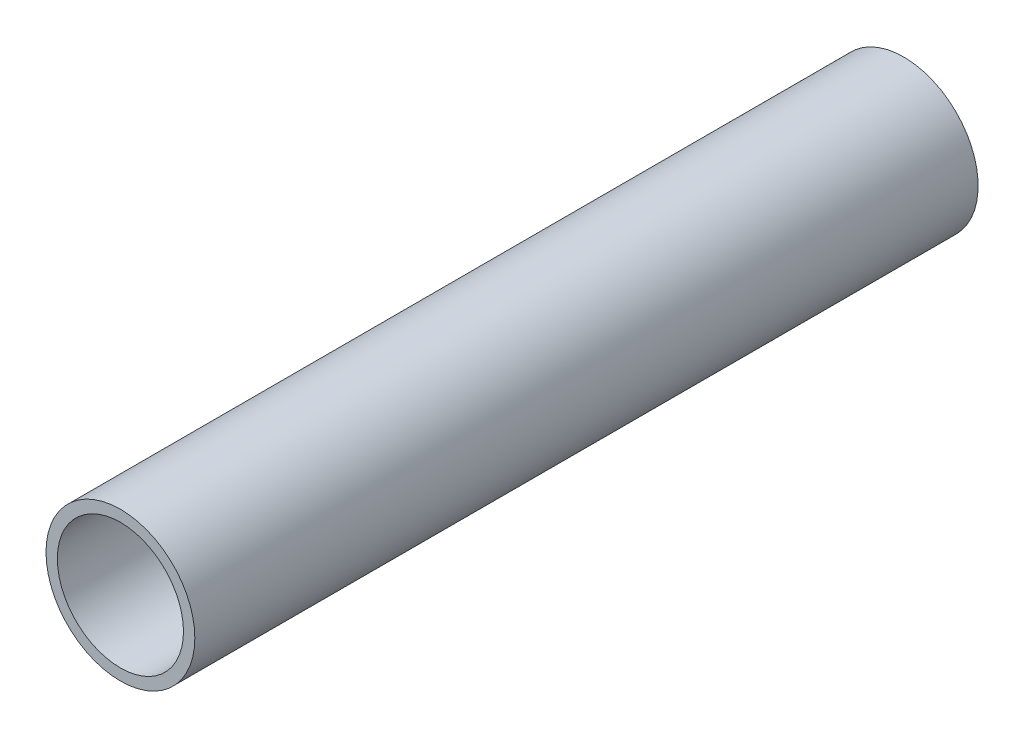
ISO-10303-21;
HEADER;
FILE_DESCRIPTION(('STEP AP214'),'2;1');
FILE_NAME('part.step','',(''),(''),'','','');
FILE_SCHEMA(('AUTOMOTIVE_DESIGN { 1 0 10303 214 1 1 1 1 }'));
ENDSEC;
DATA;
#1=APPLICATION_CONTEXT('core data for automotive mechanical design processes');
#2=APPLICATION_PROTOCOL_DEFINITION('international standard','automotive_design',2000,#1);
#3=PRODUCT_CONTEXT('',#1,'mechanical');
#4=PRODUCT('Part','Part','',(#3));
#5=PRODUCT_RELATED_PRODUCT_CATEGORY('part','',(#4));
#6=PRODUCT_DEFINITION_FORMATION('','',#4);
#7=PRODUCT_DEFINITION_CONTEXT('part definition',#1,'design');
#8=PRODUCT_DEFINITION('design','',#6,#7);
#9=PRODUCT_DEFINITION_SHAPE('','',#8);
#10=(LENGTH_UNIT() NAMED_UNIT(*) SI_UNIT(.MILLI.,.METRE.));
#11=(NAMED_UNIT(*) PLANE_ANGLE_UNIT() SI_UNIT($,.RADIAN.));
#12=(NAMED_UNIT(*) SI_UNIT($,.STERADIAN.) SOLID_ANGLE_UNIT());
#13=UNCERTAINTY_MEASURE_WITH_UNIT(LENGTH_MEASURE(1.E-05),#10,'distance_accuracy_value','');
#14=(GEOMETRIC_REPRESENTATION_CONTEXT(3) GLOBAL_UNCERTAINTY_ASSIGNED_CONTEXT((#13)) GLOBAL_UNIT_ASSIGNED_CONTEXT((#10,
#11,#12)) REPRESENTATION_CONTEXT('',''));
#15=CARTESIAN_POINT('',(0.,0.,0.));
#16=DIRECTION('',(0.,0.,1.));
#17=DIRECTION('',(1.,0.,0.));
#18=AXIS2_PLACEMENT_3D('',#15,#16,#17);
#19=CARTESIAN_POINT('',(0.,0.,762.));
#20=DIRECTION('',(0.,0.,-1.));
#21=DIRECTION('',(-1.,0.,0.));
#22=AXIS2_PLACEMENT_3D('',#19,#20,#21);
#23=CYLINDRICAL_SURFACE('',#22,24.13);
#24=CARTESIAN_POINT('',(0.,0.,-762.));
#25=DIRECTION('',(0.,0.,-1.));
#26=DIRECTION('',(-1.,0.,0.));
#27=AXIS2_PLACEMENT_3D('',#24,#25,#26);
#28=CIRCLE('',#27,24.13);
#29=CARTESIAN_POINT('',(-24.13,0.,-762.));
#30=VERTEX_POINT('',#29);
#31=EDGE_CURVE('E38',#30,#30,#28,.T.);
#32=ORIENTED_EDGE('',*,*,#31,.F.);
#33=EDGE_LOOP('',(#32));
#34=FACE_BOUND('',#33,.T.);
#35=CARTESIAN_POINT('',(0.,0.,-508.));
#36=DIRECTION('',(0.,0.,1.));
#37=DIRECTION('',(1.,0.,0.));
#38=AXIS2_PLACEMENT_3D('',#35,#36,#37);
#39=CIRCLE('',#38,24.13);
#40=CARTESIAN_POINT('',(24.13,0.,-508.));
#41=VERTEX_POINT('',#40);
#42=EDGE_CURVE('E42',#41,#41,#39,.F.);
#43=ORIENTED_EDGE('',*,*,#42,.T.);
#44=EDGE_LOOP('',(#43));
#45=FACE_BOUND('',#44,.T.);
#46=ADVANCED_FACE('F31',(#34,#45),#23,.T.);
#47=CARTESIAN_POINT('',(0.,0.,762.));
#48=DIRECTION('',(0.,0.,-1.));
#49=DIRECTION('',(-1.,0.,0.));
#50=AXIS2_PLACEMENT_3D('',#47,#48,#49);
#51=CYLINDRICAL_SURFACE('',#50,20.447);
#52=CARTESIAN_POINT('',(0.,0.,-762.));
#53=DIRECTION('',(0.,0.,-1.));
#54=DIRECTION('',(-1.,0.,0.));
#55=AXIS2_PLACEMENT_3D('',#52,#53,#54);
#56=CIRCLE('',#55,20.447);
#57=CARTESIAN_POINT('',(-20.447,0.,-762.));
#58=VERTEX_POINT('',#57);
#59=EDGE_CURVE('E10',#58,#58,#56,.T.);
#60=ORIENTED_EDGE('',*,*,#59,.T.);
#61=EDGE_LOOP('',(#60));
#62=FACE_BOUND('',#61,.T.);
#63=CARTESIAN_POINT('',(0.,0.,-508.));
#64=DIRECTION('',(0.,0.,1.));
#65=DIRECTION('',(1.,0.,0.));
#66=AXIS2_PLACEMENT_3D('',#63,#64,#65);
#67=CIRCLE('',#66,20.447);
#68=CARTESIAN_POINT('',(20.447,0.,-508.));
#69=VERTEX_POINT('',#68);
#70=EDGE_CURVE('E34',#69,#69,#67,.T.);
#71=ORIENTED_EDGE('',*,*,#70,.T.);
#72=EDGE_LOOP('',(#71));
#73=FACE_BOUND('',#72,.T.);
#74=ADVANCED_FACE('F51',(#62,#73),#51,.F.);
#75=CARTESIAN_POINT('',(20.447,0.,-762.));
#76=DIRECTION('',(0.,0.,-1.));
#77=DIRECTION('',(-1.,0.,0.));
#78=AXIS2_PLACEMENT_3D('',#75,#76,#77);
#79=PLANE('',#78);
#80=ORIENTED_EDGE('',*,*,#31,.T.);
#81=EDGE_LOOP('',(#80));
#82=FACE_BOUND('',#81,.T.);
#83=ORIENTED_EDGE('',*,*,#59,.F.);
#84=EDGE_LOOP('',(#83));
#85=FACE_BOUND('',#84,.T.);
#86=ADVANCED_FACE('F55',(#82,#85),#79,.T.);
#87=CARTESIAN_POINT('',(0.,0.,-508.));
#88=DIRECTION('',(0.,0.,1.));
#89=DIRECTION('',(1.,0.,0.));
#90=AXIS2_PLACEMENT_3D('',#87,#88,#89);
#91=PLANE('',#90);
#92=ORIENTED_EDGE('',*,*,#42,.F.);
#93=EDGE_LOOP('',(#92));
#94=FACE_BOUND('',#93,.T.);
#95=ORIENTED_EDGE('',*,*,#70,.F.);
#96=EDGE_LOOP('',(#95));
#97=FACE_BOUND('',#96,.T.);
#98=ADVANCED_FACE('F53',(#94,#97),#91,.T.);
#99=CLOSED_SHELL('',(#46,#74,#86,#98));
#100=MANIFOLD_SOLID_BREP('B2',#99);
#101=ADVANCED_BREP_SHAPE_REPRESENTATION('',(#18,#100),#14);
#102=SHAPE_DEFINITION_REPRESENTATION(#9,#101);
ENDSEC;
END-ISO-10303-21;
